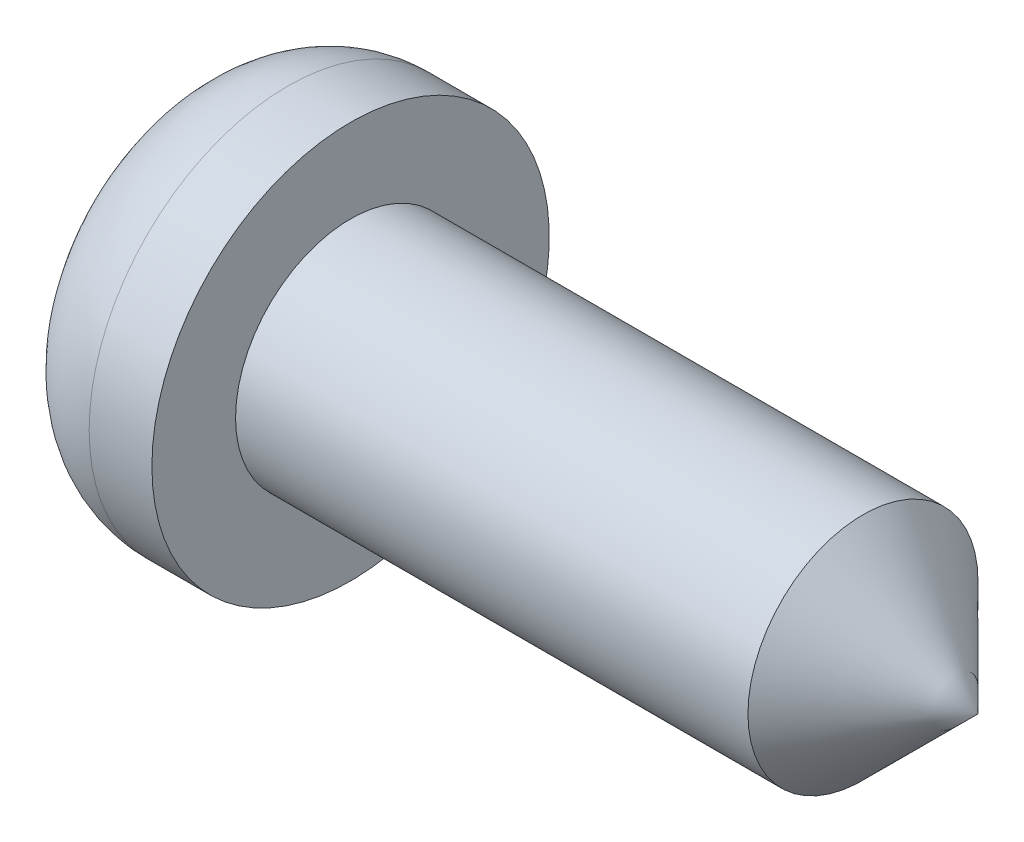
ISO-10303-21;
HEADER;
FILE_DESCRIPTION(('STEP AP214'),'2;1');
FILE_NAME('part.step','',(''),(''),'','','');
FILE_SCHEMA(('AUTOMOTIVE_DESIGN { 1 0 10303 214 1 1 1 1 }'));
ENDSEC;
DATA;
#1=APPLICATION_CONTEXT('core data for automotive mechanical design processes');
#2=APPLICATION_PROTOCOL_DEFINITION('international standard','automotive_design',2000,#1);
#3=PRODUCT_CONTEXT('',#1,'mechanical');
#4=PRODUCT('Part','Part','',(#3));
#5=PRODUCT_RELATED_PRODUCT_CATEGORY('part','',(#4));
#6=PRODUCT_DEFINITION_FORMATION('','',#4);
#7=PRODUCT_DEFINITION_CONTEXT('part definition',#1,'design');
#8=PRODUCT_DEFINITION('design','',#6,#7);
#9=PRODUCT_DEFINITION_SHAPE('','',#8);
#10=(LENGTH_UNIT() NAMED_UNIT(*) SI_UNIT(.MILLI.,.METRE.));
#11=(NAMED_UNIT(*) PLANE_ANGLE_UNIT() SI_UNIT($,.RADIAN.));
#12=(NAMED_UNIT(*) SI_UNIT($,.STERADIAN.) SOLID_ANGLE_UNIT());
#13=UNCERTAINTY_MEASURE_WITH_UNIT(LENGTH_MEASURE(1.E-05),#10,'distance_accuracy_value','');
#14=(GEOMETRIC_REPRESENTATION_CONTEXT(3) GLOBAL_UNCERTAINTY_ASSIGNED_CONTEXT((#13)) GLOBAL_UNIT_ASSIGNED_CONTEXT((#10,
#11,#12)) REPRESENTATION_CONTEXT('',''));
#15=CARTESIAN_POINT('',(0.,0.,0.));
#16=DIRECTION('',(0.,0.,1.));
#17=DIRECTION('',(1.,0.,0.));
#18=AXIS2_PLACEMENT_3D('',#15,#16,#17);
#19=CARTESIAN_POINT('',(0.,0.,0.));
#20=DIRECTION('',(1.,0.,0.));
#21=DIRECTION('',(0.,0.,-1.));
#22=AXIS2_PLACEMENT_3D('',#19,#20,#21);
#23=PLANE('',#22);
#24=DIRECTION('',(0.,-1.,0.));
#25=VECTOR('',#24,1.);
#26=CARTESIAN_POINT('',(0.,1.,-0.3));
#27=LINE('',#26,#25);
#28=CARTESIAN_POINT('',(0.,0.848528137423857,-0.3));
#29=VERTEX_POINT('',#28);
#30=CARTESIAN_POINT('',(0.,0.3,-0.3));
#31=VERTEX_POINT('',#30);
#32=EDGE_CURVE('E164',#29,#31,#27,.T.);
#33=ORIENTED_EDGE('',*,*,#32,.F.);
#34=CARTESIAN_POINT('',(0.,0.,0.));
#35=DIRECTION('',(1.,0.,0.));
#36=DIRECTION('',(0.,0.,-1.));
#37=AXIS2_PLACEMENT_3D('',#34,#35,#36);
#38=CIRCLE('',#37,0.9);
#39=CARTESIAN_POINT('',(0.,0.3,-0.848528137423857));
#40=VERTEX_POINT('',#39);
#41=EDGE_CURVE('E271',#29,#40,#38,.F.);
#42=ORIENTED_EDGE('',*,*,#41,.T.);
#43=DIRECTION('',(0.,0.,-1.));
#44=VECTOR('',#43,1.);
#45=CARTESIAN_POINT('',(0.,0.3,-0.3));
#46=LINE('',#45,#44);
#47=EDGE_CURVE('E214',#31,#40,#46,.T.);
#48=ORIENTED_EDGE('',*,*,#47,.F.);
#49=EDGE_LOOP('',(#33,#42,#48));
#50=FACE_BOUND('',#49,.T.);
#51=ADVANCED_FACE('F39',(#50),#23,.F.);
#52=DIRECTION('',(0.,0.,1.));
#53=VECTOR('',#52,1.);
#54=CARTESIAN_POINT('',(0.,-0.3,-1.));
#55=LINE('',#54,#53);
#56=CARTESIAN_POINT('',(0.,-0.3,-0.848528137423857));
#57=VERTEX_POINT('',#56);
#58=CARTESIAN_POINT('',(0.,-0.3,-0.3));
#59=VERTEX_POINT('',#58);
#60=EDGE_CURVE('E216',#57,#59,#55,.T.);
#61=ORIENTED_EDGE('',*,*,#60,.F.);
#62=CARTESIAN_POINT('',(0.,0.,0.));
#63=DIRECTION('',(1.,0.,0.));
#64=DIRECTION('',(0.,0.,-1.));
#65=AXIS2_PLACEMENT_3D('',#62,#63,#64);
#66=CIRCLE('',#65,0.9);
#67=CARTESIAN_POINT('',(0.,-0.848528137423857,-0.3));
#68=VERTEX_POINT('',#67);
#69=EDGE_CURVE('E269',#57,#68,#66,.F.);
#70=ORIENTED_EDGE('',*,*,#69,.T.);
#71=DIRECTION('',(0.,-1.,0.));
#72=VECTOR('',#71,1.);
#73=CARTESIAN_POINT('',(0.,-0.3,-0.3));
#74=LINE('',#73,#72);
#75=EDGE_CURVE('E218',#59,#68,#74,.T.);
#76=ORIENTED_EDGE('',*,*,#75,.F.);
#77=EDGE_LOOP('',(#61,#70,#76));
#78=FACE_BOUND('',#77,.T.);
#79=ADVANCED_FACE('F388',(#78),#23,.F.);
#80=DIRECTION('',(0.,1.,0.));
#81=VECTOR('',#80,1.);
#82=CARTESIAN_POINT('',(0.,-1.,0.3));
#83=LINE('',#82,#81);
#84=CARTESIAN_POINT('',(0.,-0.848528137423857,0.3));
#85=VERTEX_POINT('',#84);
#86=CARTESIAN_POINT('',(0.,-0.3,0.3));
#87=VERTEX_POINT('',#86);
#88=EDGE_CURVE('E221',#85,#87,#83,.T.);
#89=ORIENTED_EDGE('',*,*,#88,.F.);
#90=CARTESIAN_POINT('',(0.,0.,0.));
#91=DIRECTION('',(1.,0.,0.));
#92=DIRECTION('',(0.,0.,-1.));
#93=AXIS2_PLACEMENT_3D('',#90,#91,#92);
#94=CIRCLE('',#93,0.9);
#95=CARTESIAN_POINT('',(0.,-0.3,0.848528137423857));
#96=VERTEX_POINT('',#95);
#97=EDGE_CURVE('E267',#85,#96,#94,.F.);
#98=ORIENTED_EDGE('',*,*,#97,.T.);
#99=DIRECTION('',(0.,0.,1.));
#100=VECTOR('',#99,1.);
#101=CARTESIAN_POINT('',(0.,-0.3,0.3));
#102=LINE('',#101,#100);
#103=EDGE_CURVE('E223',#87,#96,#102,.T.);
#104=ORIENTED_EDGE('',*,*,#103,.F.);
#105=EDGE_LOOP('',(#89,#98,#104));
#106=FACE_BOUND('',#105,.T.);
#107=ADVANCED_FACE('F394',(#106),#23,.F.);
#108=DIRECTION('',(0.,0.,-1.));
#109=VECTOR('',#108,1.);
#110=CARTESIAN_POINT('',(0.,0.3,1.));
#111=LINE('',#110,#109);
#112=CARTESIAN_POINT('',(0.,0.3,0.848528137423857));
#113=VERTEX_POINT('',#112);
#114=CARTESIAN_POINT('',(0.,0.3,0.3));
#115=VERTEX_POINT('',#114);
#116=EDGE_CURVE('E185',#113,#115,#111,.T.);
#117=ORIENTED_EDGE('',*,*,#116,.F.);
#118=CARTESIAN_POINT('',(0.,0.,0.));
#119=DIRECTION('',(1.,0.,0.));
#120=DIRECTION('',(0.,0.,-1.));
#121=AXIS2_PLACEMENT_3D('',#118,#119,#120);
#122=CIRCLE('',#121,0.9);
#123=CARTESIAN_POINT('',(0.,0.848528137423857,0.3));
#124=VERTEX_POINT('',#123);
#125=EDGE_CURVE('E265',#113,#124,#122,.F.);
#126=ORIENTED_EDGE('',*,*,#125,.T.);
#127=DIRECTION('',(0.,1.,0.));
#128=VECTOR('',#127,1.);
#129=CARTESIAN_POINT('',(0.,0.3,0.3));
#130=LINE('',#129,#128);
#131=EDGE_CURVE('E183',#115,#124,#130,.T.);
#132=ORIENTED_EDGE('',*,*,#131,.F.);
#133=EDGE_LOOP('',(#117,#126,#132));
#134=FACE_BOUND('',#133,.T.);
#135=ADVANCED_FACE('F390',(#134),#23,.F.);
#136=CARTESIAN_POINT('',(-6.97654015251013,0.,0.));
#137=DIRECTION('',(-1.,0.,0.));
#138=DIRECTION('',(0.,0.,1.));
#139=AXIS2_PLACEMENT_3D('',#136,#137,#138);
#140=CYLINDRICAL_SURFACE('',#139,1.9);
#141=CARTESIAN_POINT('',(1.,0.,0.));
#142=DIRECTION('',(1.,0.,0.));
#143=DIRECTION('',(0.,0.,-1.));
#144=AXIS2_PLACEMENT_3D('',#141,#142,#143);
#145=CIRCLE('',#144,1.9);
#146=CARTESIAN_POINT('',(1.,0.,-1.9));
#147=VERTEX_POINT('',#146);
#148=EDGE_CURVE('E11',#147,#147,#145,.T.);
#149=ORIENTED_EDGE('',*,*,#148,.T.);
#150=EDGE_LOOP('',(#149));
#151=FACE_BOUND('',#150,.T.);
#152=CARTESIAN_POINT('',(1.6,0.,0.));
#153=DIRECTION('',(-1.,0.,0.));
#154=DIRECTION('',(0.,0.,1.));
#155=AXIS2_PLACEMENT_3D('',#152,#153,#154);
#156=CIRCLE('',#155,1.9);
#157=CARTESIAN_POINT('',(1.6,0.,1.9));
#158=VERTEX_POINT('',#157);
#159=EDGE_CURVE('E262',#158,#158,#156,.T.);
#160=ORIENTED_EDGE('',*,*,#159,.T.);
#161=EDGE_LOOP('',(#160));
#162=FACE_BOUND('',#161,.T.);
#163=ADVANCED_FACE('F398',(#151,#162),#140,.T.);
#164=CARTESIAN_POINT('',(1.6,1.9,0.));
#165=DIRECTION('',(-1.,0.,0.));
#166=DIRECTION('',(0.,0.,1.));
#167=AXIS2_PLACEMENT_3D('',#164,#165,#166);
#168=PLANE('',#167);
#169=ORIENTED_EDGE('',*,*,#159,.F.);
#170=EDGE_LOOP('',(#169));
#171=FACE_BOUND('',#170,.T.);
#172=CARTESIAN_POINT('',(1.6,0.,0.));
#173=DIRECTION('',(-1.,0.,0.));
#174=DIRECTION('',(0.,0.,1.));
#175=AXIS2_PLACEMENT_3D('',#172,#173,#174);
#176=CIRCLE('',#175,1.1);
#177=CARTESIAN_POINT('',(1.6,0.,1.1));
#178=VERTEX_POINT('',#177);
#179=EDGE_CURVE('E259',#178,#178,#176,.T.);
#180=ORIENTED_EDGE('',*,*,#179,.T.);
#181=EDGE_LOOP('',(#180));
#182=FACE_BOUND('',#181,.T.);
#183=ADVANCED_FACE('F404',(#171,#182),#168,.F.);
#184=CARTESIAN_POINT('',(-6.97654015251013,0.,0.));
#185=DIRECTION('',(-1.,0.,0.));
#186=DIRECTION('',(0.,0.,1.));
#187=AXIS2_PLACEMENT_3D('',#184,#185,#186);
#188=CYLINDRICAL_SURFACE('',#187,1.1);
#189=ORIENTED_EDGE('',*,*,#179,.F.);
#190=EDGE_LOOP('',(#189));
#191=FACE_BOUND('',#190,.T.);
#192=CARTESIAN_POINT('',(6.49999999999999,0.,0.));
#193=DIRECTION('',(-1.,0.,0.));
#194=DIRECTION('',(0.,0.,1.));
#195=AXIS2_PLACEMENT_3D('',#192,#193,#194);
#196=CIRCLE('',#195,1.1);
#197=CARTESIAN_POINT('',(6.49999999999999,0.,1.1));
#198=VERTEX_POINT('',#197);
#199=EDGE_CURVE('E229',#198,#198,#196,.T.);
#200=ORIENTED_EDGE('',*,*,#199,.T.);
#201=EDGE_LOOP('',(#200));
#202=FACE_BOUND('',#201,.T.);
#203=ADVANCED_FACE('F557',(#191,#202),#188,.T.);
#204=CARTESIAN_POINT('',(7.6,0.,0.));
#205=DIRECTION('',(-1.,0.,0.));
#206=DIRECTION('',(0.,0.,1.));
#207=AXIS2_PLACEMENT_3D('',#204,#205,#206);
#208=CONICAL_SURFACE('',#207,0.,0.785398163397443);
#209=ORIENTED_EDGE('',*,*,#199,.F.);
#210=EDGE_LOOP('',(#209));
#211=FACE_BOUND('',#210,.T.);
#212=CARTESIAN_POINT('',(7.6,0.,0.));
#213=VERTEX_POINT('',#212);
#214=VERTEX_LOOP('',#213);
#215=FACE_BOUND('',#214,.T.);
#216=ADVANCED_FACE('F296',(#211,#215),#208,.T.);
#217=CARTESIAN_POINT('',(0.5,1.,-0.3));
#218=DIRECTION('',(0.,0.,-1.));
#219=DIRECTION('',(0.,1.,0.));
#220=AXIS2_PLACEMENT_3D('',#217,#218,#219);
#221=PLANE('',#220);
#222=DIRECTION('',(-1.,0.,0.));
#223=VECTOR('',#222,1.);
#224=CARTESIAN_POINT('',(0.5,1.,-0.3));
#225=LINE('',#224,#223);
#226=CARTESIAN_POINT('',(0.5,1.,-0.3));
#227=VERTEX_POINT('',#226);
#228=CARTESIAN_POINT('',(0.0104267729956016,1.,-0.3));
#229=VERTEX_POINT('',#228);
#230=EDGE_CURVE('E227',#227,#229,#225,.T.);
#231=ORIENTED_EDGE('',*,*,#230,.T.);
#232=CARTESIAN_POINT('',(0.0104267729956016,1.,-0.3));
#233=CARTESIAN_POINT('',(0.00693900267911962,0.974874932143353,-0.3));
#234=CARTESIAN_POINT('',(0.00432621982371305,0.949689633589987,-0.3));
#235=CARTESIAN_POINT('',(0.000850659017374022,0.899199010652961,-0.3));
#236=CARTESIAN_POINT('',(-1.21491257557209E-05,0.873893688347612,-0.3));
#237=CARTESIAN_POINT('',(0.,0.848528137423858,-0.3));
#238=B_SPLINE_CURVE_WITH_KNOTS('',3,(#232,#233,#234,#235,#236,#237),.UNSPECIFIED.,.F.,.F.,(4,2,
4),(0.,0.0759613920175575,0.151921473467123),.UNSPECIFIED.);
#239=EDGE_CURVE('E48',#229,#29,#238,.T.);
#240=ORIENTED_EDGE('',*,*,#239,.T.);
#241=ORIENTED_EDGE('',*,*,#32,.T.);
#242=DIRECTION('',(-1.,0.,0.));
#243=VECTOR('',#242,1.);
#244=CARTESIAN_POINT('',(0.5,0.3,-0.3));
#245=LINE('',#244,#243);
#246=CARTESIAN_POINT('',(0.5,0.3,-0.3));
#247=VERTEX_POINT('',#246);
#248=EDGE_CURVE('E157',#247,#31,#245,.T.);
#249=ORIENTED_EDGE('',*,*,#248,.F.);
#250=DIRECTION('',(0.,-1.,0.));
#251=VECTOR('',#250,1.);
#252=CARTESIAN_POINT('',(0.5,1.,-0.3));
#253=LINE('',#252,#251);
#254=EDGE_CURVE('E161',#227,#247,#253,.T.);
#255=ORIENTED_EDGE('',*,*,#254,.F.);
#256=EDGE_LOOP('',(#231,#240,#241,#249,#255));
#257=FACE_BOUND('',#256,.T.);
#258=ADVANCED_FACE('F159',(#257),#221,.F.);
#259=CARTESIAN_POINT('',(0.5,1.,0.3));
#260=DIRECTION('',(0.,1.,0.));
#261=DIRECTION('',(0.,0.,1.));
#262=AXIS2_PLACEMENT_3D('',#259,#260,#261);
#263=PLANE('',#262);
#264=DIRECTION('',(-1.,0.,0.));
#265=VECTOR('',#264,1.);
#266=CARTESIAN_POINT('',(0.5,1.,0.3));
#267=LINE('',#266,#265);
#268=CARTESIAN_POINT('',(0.5,1.,0.3));
#269=VERTEX_POINT('',#268);
#270=CARTESIAN_POINT('',(0.0104267729956016,1.,0.3));
#271=VERTEX_POINT('',#270);
#272=EDGE_CURVE('E230',#269,#271,#267,.T.);
#273=ORIENTED_EDGE('',*,*,#272,.T.);
#274=CARTESIAN_POINT('',(0.0104267729956016,1.,0.3));
#275=CARTESIAN_POINT('',(0.00938394338239076,1.,0.275010256008655));
#276=CARTESIAN_POINT('',(0.00853543238006192,1.,0.250013554466161));
#277=CARTESIAN_POINT('',(0.00715181251284326,1.,0.200012774560014));
#278=CARTESIAN_POINT('',(0.00661668544849205,1.,0.175008696709125));
#279=CARTESIAN_POINT('',(0.00536866509051621,1.,0.100006818571349));
#280=CARTESIAN_POINT('',(0.0050125628933799,1.,0.0500034092856744));
#281=CARTESIAN_POINT('',(0.00501256289337982,1.,-0.0500034092856744));
#282=CARTESIAN_POINT('',(0.00536866509051605,1.,-0.100006818571349));
#283=CARTESIAN_POINT('',(0.00661668544849205,1.,-0.175008696709125));
#284=CARTESIAN_POINT('',(0.00715181251284336,1.,-0.200012774560014));
#285=CARTESIAN_POINT('',(0.00853543238006209,1.,-0.250013554466161));
#286=CARTESIAN_POINT('',(0.00938394338239089,1.,-0.275010256008655));
#287=CARTESIAN_POINT('',(0.0104267729956015,1.,-0.3));
#288=B_SPLINE_CURVE_WITH_KNOTS('',3,(#274,#275,#276,#277,#278,#279,#280,#281,#282,#283,#284,
#285,#286,#287),.UNSPECIFIED.,.F.,.F.,(4,2,2,2,2,2,4),(0.,0.075032040840793,0.150059723838016,
0.30006717597232,0.450074628106624,0.525102311103847,0.60013435194464),.UNSPECIFIED.);
#289=EDGE_CURVE('E55',#271,#229,#288,.T.);
#290=ORIENTED_EDGE('',*,*,#289,.T.);
#291=ORIENTED_EDGE('',*,*,#230,.F.);
#292=DIRECTION('',(0.,0.,-1.));
#293=VECTOR('',#292,1.);
#294=CARTESIAN_POINT('',(0.5,1.,0.3));
#295=LINE('',#294,#293);
#296=EDGE_CURVE('E169',#269,#227,#295,.T.);
#297=ORIENTED_EDGE('',*,*,#296,.F.);
#298=EDGE_LOOP('',(#273,#290,#291,#297));
#299=FACE_BOUND('',#298,.T.);
#300=ADVANCED_FACE('F295',(#299),#263,.F.);
#301=CARTESIAN_POINT('',(0.5,0.3,0.3));
#302=DIRECTION('',(0.,0.,1.));
#303=DIRECTION('',(0.,-1.,0.));
#304=AXIS2_PLACEMENT_3D('',#301,#302,#303);
#305=PLANE('',#304);
#306=ORIENTED_EDGE('',*,*,#131,.T.);
#307=CARTESIAN_POINT('',(0.,0.848528137423857,0.3));
#308=CARTESIAN_POINT('',(-1.21491257499053E-05,0.873893688347611,0.3));
#309=CARTESIAN_POINT('',(0.00085065901737734,0.89919901065296,0.3));
#310=CARTESIAN_POINT('',(0.0043262198237095,0.949689633589986,0.3));
#311=CARTESIAN_POINT('',(0.0069390026791117,0.974874932143352,0.3));
#312=CARTESIAN_POINT('',(0.0104267729955883,1.,0.3));
#313=B_SPLINE_CURVE_WITH_KNOTS('',3,(#307,#308,#309,#310,#311,#312),.UNSPECIFIED.,.F.,.F.,(4,2,
4),(0.,0.0759600814495657,0.151921473467123),.UNSPECIFIED.);
#314=EDGE_CURVE('E63',#124,#271,#313,.T.);
#315=ORIENTED_EDGE('',*,*,#314,.T.);
#316=ORIENTED_EDGE('',*,*,#272,.F.);
#317=DIRECTION('',(0.,1.,0.));
#318=VECTOR('',#317,1.);
#319=CARTESIAN_POINT('',(0.5,0.3,0.3));
#320=LINE('',#319,#318);
#321=CARTESIAN_POINT('',(0.5,0.3,0.3));
#322=VERTEX_POINT('',#321);
#323=EDGE_CURVE('E210',#322,#269,#320,.T.);
#324=ORIENTED_EDGE('',*,*,#323,.F.);
#325=DIRECTION('',(-1.,0.,0.));
#326=VECTOR('',#325,1.);
#327=CARTESIAN_POINT('',(0.5,0.3,0.3));
#328=LINE('',#327,#326);
#329=EDGE_CURVE('E232',#322,#115,#328,.T.);
#330=ORIENTED_EDGE('',*,*,#329,.T.);
#331=EDGE_LOOP('',(#306,#315,#316,#324,#330));
#332=FACE_BOUND('',#331,.T.);
#333=ADVANCED_FACE('F315',(#332),#305,.F.);
#334=CARTESIAN_POINT('',(0.5,0.3,1.));
#335=DIRECTION('',(0.,1.,0.));
#336=DIRECTION('',(0.,0.,1.));
#337=AXIS2_PLACEMENT_3D('',#334,#335,#336);
#338=PLANE('',#337);
#339=DIRECTION('',(-1.,0.,0.));
#340=VECTOR('',#339,1.);
#341=CARTESIAN_POINT('',(0.5,0.3,1.));
#342=LINE('',#341,#340);
#343=CARTESIAN_POINT('',(0.5,0.3,1.));
#344=VERTEX_POINT('',#343);
#345=CARTESIAN_POINT('',(0.0104267729956016,0.3,1.));
#346=VERTEX_POINT('',#345);
#347=EDGE_CURVE('E235',#344,#346,#342,.T.);
#348=ORIENTED_EDGE('',*,*,#347,.T.);
#349=CARTESIAN_POINT('',(0.0104267729956016,0.3,1.));
#350=CARTESIAN_POINT('',(0.00693900267911961,0.3,0.974874932143353));
#351=CARTESIAN_POINT('',(0.00432621982371302,0.3,0.949689633589987));
#352=CARTESIAN_POINT('',(0.000850659017373973,0.3,0.899199010652961));
#353=CARTESIAN_POINT('',(-1.21491257557841E-05,0.3,0.873893688347612));
#354=CARTESIAN_POINT('',(0.,0.3,0.848528137423858));
#355=B_SPLINE_CURVE_WITH_KNOTS('',3,(#349,#350,#351,#352,#353,#354),.UNSPECIFIED.,.F.,.F.,(4,2,
4),(0.,0.0759613920175577,0.151921473467123),.UNSPECIFIED.);
#356=EDGE_CURVE('E327',#346,#113,#355,.T.);
#357=ORIENTED_EDGE('',*,*,#356,.T.);
#358=ORIENTED_EDGE('',*,*,#116,.T.);
#359=ORIENTED_EDGE('',*,*,#329,.F.);
#360=DIRECTION('',(0.,0.,-1.));
#361=VECTOR('',#360,1.);
#362=CARTESIAN_POINT('',(0.5,0.3,1.));
#363=LINE('',#362,#361);
#364=EDGE_CURVE('E207',#344,#322,#363,.T.);
#365=ORIENTED_EDGE('',*,*,#364,.F.);
#366=EDGE_LOOP('',(#348,#357,#358,#359,#365));
#367=FACE_BOUND('',#366,.T.);
#368=ADVANCED_FACE('F319',(#367),#338,.F.);
#369=CARTESIAN_POINT('',(0.5,-0.3,1.));
#370=DIRECTION('',(0.,0.,1.));
#371=DIRECTION('',(1.,0.,0.));
#372=AXIS2_PLACEMENT_3D('',#369,#370,#371);
#373=PLANE('',#372);
#374=DIRECTION('',(-1.,0.,0.));
#375=VECTOR('',#374,1.);
#376=CARTESIAN_POINT('',(0.5,-0.3,1.));
#377=LINE('',#376,#375);
#378=CARTESIAN_POINT('',(0.5,-0.3,1.));
#379=VERTEX_POINT('',#378);
#380=CARTESIAN_POINT('',(0.0104267729956016,-0.3,1.));
#381=VERTEX_POINT('',#380);
#382=EDGE_CURVE('E238',#379,#381,#377,.T.);
#383=ORIENTED_EDGE('',*,*,#382,.T.);
#384=CARTESIAN_POINT('',(0.0104267729956016,-0.3,1.));
#385=CARTESIAN_POINT('',(0.00938394338239074,-0.275010256008655,1.));
#386=CARTESIAN_POINT('',(0.0085354323800619,-0.250013554466161,1.));
#387=CARTESIAN_POINT('',(0.00715181251284322,-0.200012774560014,1.));
#388=CARTESIAN_POINT('',(0.00661668544849202,-0.175008696709125,1.));
#389=CARTESIAN_POINT('',(0.00536866509051619,-0.100006818571349,1.));
#390=CARTESIAN_POINT('',(0.00501256289337989,-0.0500034092856743,1.));
#391=CARTESIAN_POINT('',(0.00501256289337981,0.0500034092856744,1.));
#392=CARTESIAN_POINT('',(0.00536866509051603,0.100006818571349,1.));
#393=CARTESIAN_POINT('',(0.00661668544849203,0.175008696709125,1.));
#394=CARTESIAN_POINT('',(0.00715181251284334,0.200012774560014,1.));
#395=CARTESIAN_POINT('',(0.00853543238006207,0.250013554466161,1.));
#396=CARTESIAN_POINT('',(0.00938394338239086,0.275010256008655,1.));
#397=CARTESIAN_POINT('',(0.0104267729956014,0.3,1.));
#398=B_SPLINE_CURVE_WITH_KNOTS('',3,(#384,#385,#386,#387,#388,#389,#390,#391,#392,#393,#394,
#395,#396,#397),.UNSPECIFIED.,.F.,.F.,(4,2,2,2,2,2,4),(0.,0.075032040840793,0.150059723838016,
0.30006717597232,0.450074628106624,0.525102311103846,0.600134351944639),.UNSPECIFIED.);
#399=EDGE_CURVE('E332',#381,#346,#398,.T.);
#400=ORIENTED_EDGE('',*,*,#399,.T.);
#401=ORIENTED_EDGE('',*,*,#347,.F.);
#402=DIRECTION('',(0.,1.,0.));
#403=VECTOR('',#402,1.);
#404=CARTESIAN_POINT('',(0.5,-0.3,1.));
#405=LINE('',#404,#403);
#406=EDGE_CURVE('E204',#379,#344,#405,.T.);
#407=ORIENTED_EDGE('',*,*,#406,.F.);
#408=EDGE_LOOP('',(#383,#400,#401,#407));
#409=FACE_BOUND('',#408,.T.);
#410=ADVANCED_FACE('F323',(#409),#373,.F.);
#411=CARTESIAN_POINT('',(0.5,-0.3,0.3));
#412=DIRECTION('',(0.,-1.,0.));
#413=DIRECTION('',(0.,0.,-1.));
#414=AXIS2_PLACEMENT_3D('',#411,#412,#413);
#415=PLANE('',#414);
#416=ORIENTED_EDGE('',*,*,#103,.T.);
#417=CARTESIAN_POINT('',(0.,-0.3,0.848528137423857));
#418=CARTESIAN_POINT('',(-1.21491257497695E-05,-0.3,0.873893688347611));
#419=CARTESIAN_POINT('',(0.000850659017377545,-0.3,0.89919901065296));
#420=CARTESIAN_POINT('',(0.00432621982370971,-0.3,0.949689633589986));
#421=CARTESIAN_POINT('',(0.00693900267911183,-0.3,0.974874932143352));
#422=CARTESIAN_POINT('',(0.0104267729955883,-0.3,1.));
#423=B_SPLINE_CURVE_WITH_KNOTS('',3,(#417,#418,#419,#420,#421,#422),.UNSPECIFIED.,.F.,.F.,(4,2,
4),(0.,0.075960081449566,0.151921473467123),.UNSPECIFIED.);
#424=EDGE_CURVE('E337',#96,#381,#423,.T.);
#425=ORIENTED_EDGE('',*,*,#424,.T.);
#426=ORIENTED_EDGE('',*,*,#382,.F.);
#427=DIRECTION('',(0.,0.,1.));
#428=VECTOR('',#427,1.);
#429=CARTESIAN_POINT('',(0.5,-0.3,0.3));
#430=LINE('',#429,#428);
#431=CARTESIAN_POINT('',(0.5,-0.3,0.3));
#432=VERTEX_POINT('',#431);
#433=EDGE_CURVE('E201',#432,#379,#430,.T.);
#434=ORIENTED_EDGE('',*,*,#433,.F.);
#435=DIRECTION('',(-1.,0.,0.));
#436=VECTOR('',#435,1.);
#437=CARTESIAN_POINT('',(0.5,-0.3,0.3));
#438=LINE('',#437,#436);
#439=EDGE_CURVE('E241',#432,#87,#438,.T.);
#440=ORIENTED_EDGE('',*,*,#439,.T.);
#441=EDGE_LOOP('',(#416,#425,#426,#434,#440));
#442=FACE_BOUND('',#441,.T.);
#443=ADVANCED_FACE('F348',(#442),#415,.F.);
#444=CARTESIAN_POINT('',(0.5,-1.,0.3));
#445=DIRECTION('',(0.,0.,1.));
#446=DIRECTION('',(1.,0.,0.));
#447=AXIS2_PLACEMENT_3D('',#444,#445,#446);
#448=PLANE('',#447);
#449=DIRECTION('',(-1.,0.,0.));
#450=VECTOR('',#449,1.);
#451=CARTESIAN_POINT('',(0.5,-1.,0.3));
#452=LINE('',#451,#450);
#453=CARTESIAN_POINT('',(0.5,-1.,0.3));
#454=VERTEX_POINT('',#453);
#455=CARTESIAN_POINT('',(0.0104267729956016,-1.,0.3));
#456=VERTEX_POINT('',#455);
#457=EDGE_CURVE('E244',#454,#456,#452,.T.);
#458=ORIENTED_EDGE('',*,*,#457,.T.);
#459=CARTESIAN_POINT('',(0.0104267729956016,-1.,0.3));
#460=CARTESIAN_POINT('',(0.00693900267911962,-0.974874932143353,0.3));
#461=CARTESIAN_POINT('',(0.00432621982371304,-0.949689633589987,0.3));
#462=CARTESIAN_POINT('',(0.000850659017374014,-0.899199010652961,0.3));
#463=CARTESIAN_POINT('',(-1.21491257557325E-05,-0.873893688347612,0.3));
#464=CARTESIAN_POINT('',(0.,-0.848528137423858,0.3));
#465=B_SPLINE_CURVE_WITH_KNOTS('',3,(#459,#460,#461,#462,#463,#464),.UNSPECIFIED.,.F.,.F.,(4,2,
4),(0.,0.0759613920175575,0.151921473467123),.UNSPECIFIED.);
#466=EDGE_CURVE('E342',#456,#85,#465,.T.);
#467=ORIENTED_EDGE('',*,*,#466,.T.);
#468=ORIENTED_EDGE('',*,*,#88,.T.);
#469=ORIENTED_EDGE('',*,*,#439,.F.);
#470=DIRECTION('',(0.,1.,0.));
#471=VECTOR('',#470,1.);
#472=CARTESIAN_POINT('',(0.5,-1.,0.3));
#473=LINE('',#472,#471);
#474=EDGE_CURVE('E198',#454,#432,#473,.T.);
#475=ORIENTED_EDGE('',*,*,#474,.F.);
#476=EDGE_LOOP('',(#458,#467,#468,#469,#475));
#477=FACE_BOUND('',#476,.T.);
#478=ADVANCED_FACE('F351',(#477),#448,.F.);
#479=CARTESIAN_POINT('',(0.5,-1.,-0.3));
#480=DIRECTION('',(0.,-1.,0.));
#481=DIRECTION('',(0.,0.,-1.));
#482=AXIS2_PLACEMENT_3D('',#479,#480,#481);
#483=PLANE('',#482);
#484=DIRECTION('',(-1.,0.,0.));
#485=VECTOR('',#484,1.);
#486=CARTESIAN_POINT('',(0.5,-1.,-0.3));
#487=LINE('',#486,#485);
#488=CARTESIAN_POINT('',(0.5,-1.,-0.3));
#489=VERTEX_POINT('',#488);
#490=CARTESIAN_POINT('',(0.0104267729956014,-1.,-0.3));
#491=VERTEX_POINT('',#490);
#492=EDGE_CURVE('E247',#489,#491,#487,.T.);
#493=ORIENTED_EDGE('',*,*,#492,.T.);
#494=CARTESIAN_POINT('',(0.0104267729956014,-1.,-0.3));
#495=CARTESIAN_POINT('',(0.00938394338239082,-1.,-0.275010256008655));
#496=CARTESIAN_POINT('',(0.00853543238006206,-1.,-0.250013554466161));
#497=CARTESIAN_POINT('',(0.00715181251284338,-1.,-0.200012774560014));
#498=CARTESIAN_POINT('',(0.0066166854484921,-1.,-0.175008696709125));
#499=CARTESIAN_POINT('',(0.00536866509051615,-1.,-0.100006818571348));
#500=CARTESIAN_POINT('',(0.00501256289337995,-1.,-0.050003409285674));
#501=CARTESIAN_POINT('',(0.00501256289338004,-1.,0.0500034092856747));
#502=CARTESIAN_POINT('',(0.00536866509051634,-1.,0.100006818571349));
#503=CARTESIAN_POINT('',(0.00661668544849213,-1.,0.175008696709126));
#504=CARTESIAN_POINT('',(0.00715181251284331,-1.,0.200012774560015));
#505=CARTESIAN_POINT('',(0.00853543238006193,-1.,0.250013554466162));
#506=CARTESIAN_POINT('',(0.00938394338239074,-1.,0.275010256008655));
#507=CARTESIAN_POINT('',(0.0104267729956015,-1.,0.3));
#508=B_SPLINE_CURVE_WITH_KNOTS('',3,(#494,#495,#496,#497,#498,#499,#500,#501,#502,#503,#504,
#505,#506,#507),.UNSPECIFIED.,.F.,.F.,(4,2,2,2,2,2,4),(0.,0.075032040840793,0.150059723838016,
0.30006717597232,0.450074628106624,0.525102311103847,0.600134351944639),.UNSPECIFIED.);
#509=EDGE_CURVE('E364',#491,#456,#508,.T.);
#510=ORIENTED_EDGE('',*,*,#509,.T.);
#511=ORIENTED_EDGE('',*,*,#457,.F.);
#512=DIRECTION('',(0.,0.,1.));
#513=VECTOR('',#512,1.);
#514=CARTESIAN_POINT('',(0.5,-1.,-0.3));
#515=LINE('',#514,#513);
#516=EDGE_CURVE('E195',#489,#454,#515,.T.);
#517=ORIENTED_EDGE('',*,*,#516,.F.);
#518=EDGE_LOOP('',(#493,#510,#511,#517));
#519=FACE_BOUND('',#518,.T.);
#520=ADVANCED_FACE('F356',(#519),#483,.F.);
#521=CARTESIAN_POINT('',(0.5,-0.3,-0.3));
#522=DIRECTION('',(0.,0.,-1.));
#523=DIRECTION('',(0.,1.,0.));
#524=AXIS2_PLACEMENT_3D('',#521,#522,#523);
#525=PLANE('',#524);
#526=ORIENTED_EDGE('',*,*,#75,.T.);
#527=CARTESIAN_POINT('',(0.,-0.848528137423857,-0.3));
#528=CARTESIAN_POINT('',(-1.2149125749767E-05,-0.873893688347611,-0.3));
#529=CARTESIAN_POINT('',(0.000850659017377548,-0.89919901065296,-0.3));
#530=CARTESIAN_POINT('',(0.00432621982370971,-0.949689633589986,-0.3));
#531=CARTESIAN_POINT('',(0.00693900267911184,-0.974874932143352,-0.3));
#532=CARTESIAN_POINT('',(0.0104267729955883,-1.,-0.3));
#533=B_SPLINE_CURVE_WITH_KNOTS('',3,(#527,#528,#529,#530,#531,#532),.UNSPECIFIED.,.F.,.F.,(4,2,
4),(0.,0.0759600814495658,0.151921473467123),.UNSPECIFIED.);
#534=EDGE_CURVE('E369',#68,#491,#533,.T.);
#535=ORIENTED_EDGE('',*,*,#534,.T.);
#536=ORIENTED_EDGE('',*,*,#492,.F.);
#537=DIRECTION('',(0.,-1.,0.));
#538=VECTOR('',#537,1.);
#539=CARTESIAN_POINT('',(0.5,-0.3,-0.3));
#540=LINE('',#539,#538);
#541=CARTESIAN_POINT('',(0.5,-0.3,-0.3));
#542=VERTEX_POINT('',#541);
#543=EDGE_CURVE('E192',#542,#489,#540,.T.);
#544=ORIENTED_EDGE('',*,*,#543,.F.);
#545=DIRECTION('',(-1.,0.,0.));
#546=VECTOR('',#545,1.);
#547=CARTESIAN_POINT('',(0.5,-0.3,-0.3));
#548=LINE('',#547,#546);
#549=EDGE_CURVE('E250',#542,#59,#548,.T.);
#550=ORIENTED_EDGE('',*,*,#549,.T.);
#551=EDGE_LOOP('',(#526,#535,#536,#544,#550));
#552=FACE_BOUND('',#551,.T.);
#553=ADVANCED_FACE('F361',(#552),#525,.F.);
#554=CARTESIAN_POINT('',(0.5,-0.3,-1.));
#555=DIRECTION('',(0.,-1.,0.));
#556=DIRECTION('',(0.,0.,-1.));
#557=AXIS2_PLACEMENT_3D('',#554,#555,#556);
#558=PLANE('',#557);
#559=DIRECTION('',(-1.,0.,0.));
#560=VECTOR('',#559,1.);
#561=CARTESIAN_POINT('',(0.5,-0.3,-1.));
#562=LINE('',#561,#560);
#563=CARTESIAN_POINT('',(0.5,-0.3,-1.));
#564=VERTEX_POINT('',#563);
#565=CARTESIAN_POINT('',(0.0104267729956016,-0.3,-1.));
#566=VERTEX_POINT('',#565);
#567=EDGE_CURVE('E253',#564,#566,#562,.T.);
#568=ORIENTED_EDGE('',*,*,#567,.T.);
#569=CARTESIAN_POINT('',(0.0104267729956016,-0.3,-1.));
#570=CARTESIAN_POINT('',(0.00693900267911962,-0.3,-0.974874932143353));
#571=CARTESIAN_POINT('',(0.00432621982371304,-0.3,-0.949689633589987));
#572=CARTESIAN_POINT('',(0.000850659017374014,-0.3,-0.899199010652961));
#573=CARTESIAN_POINT('',(-1.21491257557325E-05,-0.3,-0.873893688347612));
#574=CARTESIAN_POINT('',(0.,-0.3,-0.848528137423858));
#575=B_SPLINE_CURVE_WITH_KNOTS('',3,(#569,#570,#571,#572,#573,#574),.UNSPECIFIED.,.F.,.F.,(4,2,
4),(0.,0.0759613920175575,0.151921473467123),.UNSPECIFIED.);
#576=EDGE_CURVE('E373',#566,#57,#575,.T.);
#577=ORIENTED_EDGE('',*,*,#576,.T.);
#578=ORIENTED_EDGE('',*,*,#60,.T.);
#579=ORIENTED_EDGE('',*,*,#549,.F.);
#580=DIRECTION('',(0.,0.,1.));
#581=VECTOR('',#580,1.);
#582=CARTESIAN_POINT('',(0.5,-0.3,-1.));
#583=LINE('',#582,#581);
#584=EDGE_CURVE('E189',#564,#542,#583,.T.);
#585=ORIENTED_EDGE('',*,*,#584,.F.);
#586=EDGE_LOOP('',(#568,#577,#578,#579,#585));
#587=FACE_BOUND('',#586,.T.);
#588=ADVANCED_FACE('F377',(#587),#558,.F.);
#589=CARTESIAN_POINT('',(0.5,0.3,-1.));
#590=DIRECTION('',(0.,0.,-1.));
#591=DIRECTION('',(-1.,0.,0.));
#592=AXIS2_PLACEMENT_3D('',#589,#590,#591);
#593=PLANE('',#592);
#594=DIRECTION('',(-1.,0.,0.));
#595=VECTOR('',#594,1.);
#596=CARTESIAN_POINT('',(0.5,0.3,-1.));
#597=LINE('',#596,#595);
#598=CARTESIAN_POINT('',(0.5,0.3,-1.));
#599=VERTEX_POINT('',#598);
#600=CARTESIAN_POINT('',(0.0104267729956016,0.3,-1.));
#601=VERTEX_POINT('',#600);
#602=EDGE_CURVE('E168',#599,#601,#597,.T.);
#603=ORIENTED_EDGE('',*,*,#602,.T.);
#604=CARTESIAN_POINT('',(0.0104267729956016,0.3,-1.));
#605=CARTESIAN_POINT('',(0.00938394338239076,0.275010256008655,-1.));
#606=CARTESIAN_POINT('',(0.00853543238006192,0.250013554466161,-1.));
#607=CARTESIAN_POINT('',(0.00715181251284326,0.200012774560014,-1.));
#608=CARTESIAN_POINT('',(0.00661668544849205,0.175008696709125,-1.));
#609=CARTESIAN_POINT('',(0.00536866509051622,0.100006818571349,-1.));
#610=CARTESIAN_POINT('',(0.00501256289337991,0.0500034092856743,-1.));
#611=CARTESIAN_POINT('',(0.00501256289337983,-0.0500034092856744,-1.));
#612=CARTESIAN_POINT('',(0.00536866509051605,-0.100006818571349,-1.));
#613=CARTESIAN_POINT('',(0.00661668544849206,-0.175008696709125,-1.));
#614=CARTESIAN_POINT('',(0.00715181251284337,-0.200012774560014,-1.));
#615=CARTESIAN_POINT('',(0.0085354323800621,-0.250013554466161,-1.));
#616=CARTESIAN_POINT('',(0.0093839433823909,-0.275010256008655,-1.));
#617=CARTESIAN_POINT('',(0.0104267729956015,-0.3,-1.));
#618=B_SPLINE_CURVE_WITH_KNOTS('',3,(#604,#605,#606,#607,#608,#609,#610,#611,#612,#613,#614,
#615,#616,#617),.UNSPECIFIED.,.F.,.F.,(4,2,2,2,2,2,4),(0.,0.075032040840793,0.150059723838016,
0.30006717597232,0.450074628106624,0.525102311103846,0.600134351944639),.UNSPECIFIED.);
#619=EDGE_CURVE('E280',#601,#566,#618,.T.);
#620=ORIENTED_EDGE('',*,*,#619,.T.);
#621=ORIENTED_EDGE('',*,*,#567,.F.);
#622=DIRECTION('',(0.,-1.,0.));
#623=VECTOR('',#622,1.);
#624=CARTESIAN_POINT('',(0.5,0.3,-1.));
#625=LINE('',#624,#623);
#626=EDGE_CURVE('E178',#599,#564,#625,.T.);
#627=ORIENTED_EDGE('',*,*,#626,.F.);
#628=EDGE_LOOP('',(#603,#620,#621,#627));
#629=FACE_BOUND('',#628,.T.);
#630=ADVANCED_FACE('F289',(#629),#593,.F.);
#631=CARTESIAN_POINT('',(0.5,0.3,-0.3));
#632=DIRECTION('',(0.,1.,0.));
#633=DIRECTION('',(0.,0.,1.));
#634=AXIS2_PLACEMENT_3D('',#631,#632,#633);
#635=PLANE('',#634);
#636=ORIENTED_EDGE('',*,*,#47,.T.);
#637=CARTESIAN_POINT('',(0.,0.3,-0.848528137423857));
#638=CARTESIAN_POINT('',(-1.21491257497654E-05,0.3,-0.873893688347611));
#639=CARTESIAN_POINT('',(0.000850659017377548,0.3,-0.89919901065296));
#640=CARTESIAN_POINT('',(0.00432621982370971,0.3,-0.949689633589986));
#641=CARTESIAN_POINT('',(0.00693900267911183,0.3,-0.974874932143352));
#642=CARTESIAN_POINT('',(0.0104267729955883,0.3,-1.));
#643=B_SPLINE_CURVE_WITH_KNOTS('',3,(#637,#638,#639,#640,#641,#642),.UNSPECIFIED.,.F.,.F.,(4,2,
4),(0.,0.0759600814495658,0.151921473467123),.UNSPECIFIED.);
#644=EDGE_CURVE('E274',#40,#601,#643,.T.);
#645=ORIENTED_EDGE('',*,*,#644,.T.);
#646=ORIENTED_EDGE('',*,*,#602,.F.);
#647=DIRECTION('',(0.,0.,-1.));
#648=VECTOR('',#647,1.);
#649=CARTESIAN_POINT('',(0.5,0.3,-0.3));
#650=LINE('',#649,#648);
#651=EDGE_CURVE('E172',#247,#599,#650,.T.);
#652=ORIENTED_EDGE('',*,*,#651,.F.);
#653=ORIENTED_EDGE('',*,*,#248,.T.);
#654=EDGE_LOOP('',(#636,#645,#646,#652,#653));
#655=FACE_BOUND('',#654,.T.);
#656=ADVANCED_FACE('F173',(#655),#635,.F.);
#657=CARTESIAN_POINT('',(0.5,0.,0.));
#658=DIRECTION('',(1.,0.,0.));
#659=DIRECTION('',(0.,0.,-1.));
#660=AXIS2_PLACEMENT_3D('',#657,#658,#659);
#661=PLANE('',#660);
#662=ORIENTED_EDGE('',*,*,#254,.T.);
#663=ORIENTED_EDGE('',*,*,#651,.T.);
#664=ORIENTED_EDGE('',*,*,#626,.T.);
#665=ORIENTED_EDGE('',*,*,#584,.T.);
#666=ORIENTED_EDGE('',*,*,#543,.T.);
#667=ORIENTED_EDGE('',*,*,#516,.T.);
#668=ORIENTED_EDGE('',*,*,#474,.T.);
#669=ORIENTED_EDGE('',*,*,#433,.T.);
#670=ORIENTED_EDGE('',*,*,#406,.T.);
#671=ORIENTED_EDGE('',*,*,#364,.T.);
#672=ORIENTED_EDGE('',*,*,#323,.T.);
#673=ORIENTED_EDGE('',*,*,#296,.T.);
#674=EDGE_LOOP('',(#662,#663,#664,#665,#666,#667,#668,#669,#670,#671,#672,#673));
#675=FACE_BOUND('',#674,.T.);
#676=ADVANCED_FACE('F180',(#675),#661,.F.);
#677=CARTESIAN_POINT('',(1.,0.,0.));
#678=DIRECTION('',(1.,0.,0.));
#679=DIRECTION('',(0.,0.,-1.));
#680=AXIS2_PLACEMENT_3D('',#677,#678,#679);
#681=DEGENERATE_TOROIDAL_SURFACE('',#680,0.9,1.,.T.);
#682=ORIENTED_EDGE('',*,*,#148,.F.);
#683=EDGE_LOOP('',(#682));
#684=FACE_BOUND('',#683,.T.);
#685=ORIENTED_EDGE('',*,*,#644,.F.);
#686=ORIENTED_EDGE('',*,*,#41,.F.);
#687=ORIENTED_EDGE('',*,*,#239,.F.);
#688=ORIENTED_EDGE('',*,*,#289,.F.);
#689=ORIENTED_EDGE('',*,*,#314,.F.);
#690=ORIENTED_EDGE('',*,*,#125,.F.);
#691=ORIENTED_EDGE('',*,*,#356,.F.);
#692=ORIENTED_EDGE('',*,*,#399,.F.);
#693=ORIENTED_EDGE('',*,*,#424,.F.);
#694=ORIENTED_EDGE('',*,*,#97,.F.);
#695=ORIENTED_EDGE('',*,*,#466,.F.);
#696=ORIENTED_EDGE('',*,*,#509,.F.);
#697=ORIENTED_EDGE('',*,*,#534,.F.);
#698=ORIENTED_EDGE('',*,*,#69,.F.);
#699=ORIENTED_EDGE('',*,*,#576,.F.);
#700=ORIENTED_EDGE('',*,*,#619,.F.);
#701=EDGE_LOOP('',(#685,#686,#687,#688,#689,#690,#691,#692,#693,#694,#695,#696,#697,#698,#699,#700));
#702=FACE_BOUND('',#701,.T.);
#703=ADVANCED_FACE('F41',(#684,#702),#681,.T.);
#704=CLOSED_SHELL('',(#51,#79,#107,#135,#163,#183,#203,#216,#258,#300,#333,#368,#410,#443,#478,
#520,#553,#588,#630,#656,#676,#703));
#705=MANIFOLD_SOLID_BREP('B2',#704);
#706=ADVANCED_BREP_SHAPE_REPRESENTATION('',(#18,#705),#14);
#707=SHAPE_DEFINITION_REPRESENTATION(#9,#706);
ENDSEC;
END-ISO-10303-21;
